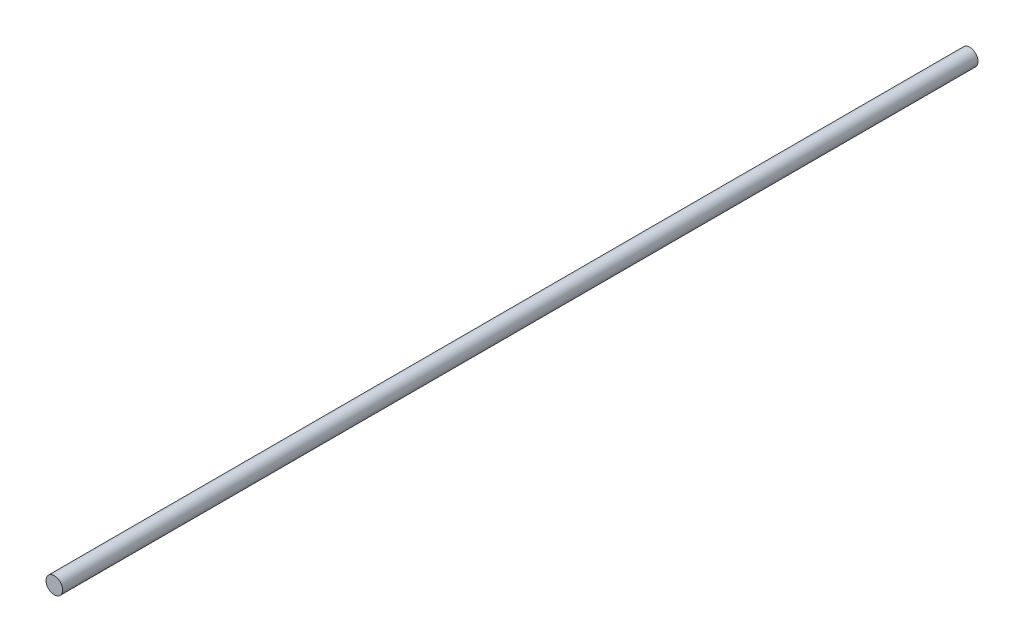
ISO-10303-21;
HEADER;
FILE_DESCRIPTION(('STEP AP214'),'2;1');
FILE_NAME('part.step','',(''),(''),'','','');
FILE_SCHEMA(('AUTOMOTIVE_DESIGN { 1 0 10303 214 1 1 1 1 }'));
ENDSEC;
DATA;
#1=APPLICATION_CONTEXT('core data for automotive mechanical design processes');
#2=APPLICATION_PROTOCOL_DEFINITION('international standard','automotive_design',2000,#1);
#3=PRODUCT_CONTEXT('',#1,'mechanical');
#4=PRODUCT('Part','Part','',(#3));
#5=PRODUCT_RELATED_PRODUCT_CATEGORY('part','',(#4));
#6=PRODUCT_DEFINITION_FORMATION('','',#4);
#7=PRODUCT_DEFINITION_CONTEXT('part definition',#1,'design');
#8=PRODUCT_DEFINITION('design','',#6,#7);
#9=PRODUCT_DEFINITION_SHAPE('','',#8);
#10=(LENGTH_UNIT() NAMED_UNIT(*) SI_UNIT(.MILLI.,.METRE.));
#11=(NAMED_UNIT(*) PLANE_ANGLE_UNIT() SI_UNIT($,.RADIAN.));
#12=(NAMED_UNIT(*) SI_UNIT($,.STERADIAN.) SOLID_ANGLE_UNIT());
#13=UNCERTAINTY_MEASURE_WITH_UNIT(LENGTH_MEASURE(1.E-05),#10,'distance_accuracy_value','');
#14=(GEOMETRIC_REPRESENTATION_CONTEXT(3) GLOBAL_UNCERTAINTY_ASSIGNED_CONTEXT((#13)) GLOBAL_UNIT_ASSIGNED_CONTEXT((#10,
#11,#12)) REPRESENTATION_CONTEXT('',''));
#15=CARTESIAN_POINT('',(0.,0.,0.));
#16=DIRECTION('',(0.,0.,1.));
#17=DIRECTION('',(1.,0.,0.));
#18=AXIS2_PLACEMENT_3D('',#15,#16,#17);
#19=CARTESIAN_POINT('',(0.,0.,270.));
#20=DIRECTION('',(0.,0.,-1.));
#21=DIRECTION('',(-1.,0.,0.));
#22=AXIS2_PLACEMENT_3D('',#19,#20,#21);
#23=CYLINDRICAL_SURFACE('',#22,2.45);
#24=CARTESIAN_POINT('',(0.,0.,270.));
#25=DIRECTION('',(0.,0.,1.));
#26=DIRECTION('',(1.,0.,0.));
#27=AXIS2_PLACEMENT_3D('',#24,#25,#26);
#28=CIRCLE('',#27,2.45);
#29=CARTESIAN_POINT('',(2.45,0.,270.));
#30=VERTEX_POINT('',#29);
#31=EDGE_CURVE('E10',#30,#30,#28,.T.);
#32=ORIENTED_EDGE('',*,*,#31,.F.);
#33=EDGE_LOOP('',(#32));
#34=FACE_BOUND('',#33,.T.);
#35=CARTESIAN_POINT('',(0.,0.,0.));
#36=DIRECTION('',(0.,0.,1.));
#37=DIRECTION('',(1.,0.,0.));
#38=AXIS2_PLACEMENT_3D('',#35,#36,#37);
#39=CIRCLE('',#38,2.45);
#40=CARTESIAN_POINT('',(2.45,0.,0.));
#41=VERTEX_POINT('',#40);
#42=EDGE_CURVE('E34',#41,#41,#39,.T.);
#43=ORIENTED_EDGE('',*,*,#42,.T.);
#44=EDGE_LOOP('',(#43));
#45=FACE_BOUND('',#44,.T.);
#46=ADVANCED_FACE('F31',(#34,#45),#23,.T.);
#47=CARTESIAN_POINT('',(0.,0.,270.));
#48=DIRECTION('',(0.,0.,1.));
#49=DIRECTION('',(1.,0.,0.));
#50=AXIS2_PLACEMENT_3D('',#47,#48,#49);
#51=PLANE('',#50);
#52=ORIENTED_EDGE('',*,*,#31,.T.);
#53=EDGE_LOOP('',(#52));
#54=FACE_BOUND('',#53,.T.);
#55=ADVANCED_FACE('F46',(#54),#51,.T.);
#56=CARTESIAN_POINT('',(0.,0.,0.));
#57=DIRECTION('',(0.,0.,1.));
#58=DIRECTION('',(1.,0.,0.));
#59=AXIS2_PLACEMENT_3D('',#56,#57,#58);
#60=PLANE('',#59);
#61=ORIENTED_EDGE('',*,*,#42,.F.);
#62=EDGE_LOOP('',(#61));
#63=FACE_BOUND('',#62,.T.);
#64=ADVANCED_FACE('F44',(#63),#60,.F.);
#65=CLOSED_SHELL('',(#46,#55,#64));
#66=MANIFOLD_SOLID_BREP('B2',#65);
#67=ADVANCED_BREP_SHAPE_REPRESENTATION('',(#18,#66),#14);
#68=SHAPE_DEFINITION_REPRESENTATION(#9,#67);
ENDSEC;
END-ISO-10303-21;
